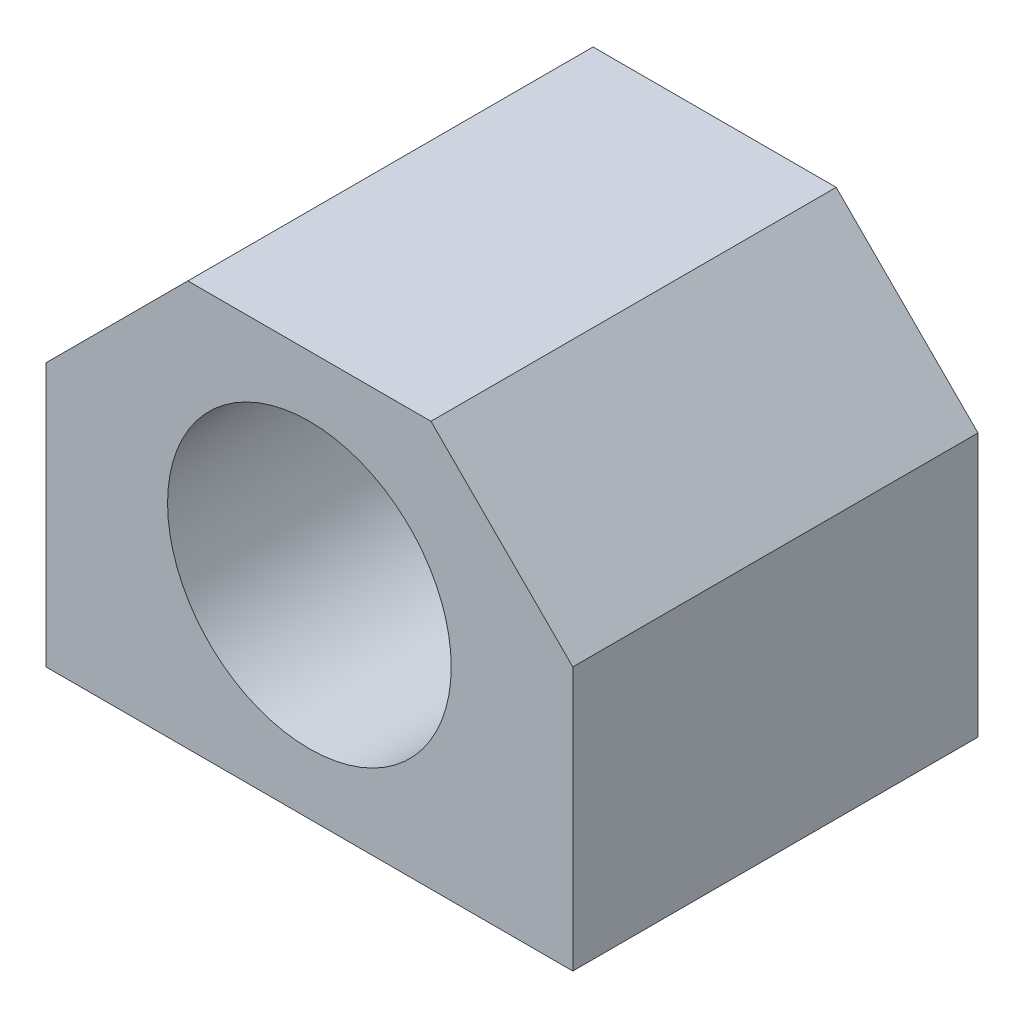
ISO-10303-21;
HEADER;
FILE_DESCRIPTION(('STEP AP214'),'2;1');
FILE_NAME('part.step','',(''),(''),'','','');
FILE_SCHEMA(('AUTOMOTIVE_DESIGN { 1 0 10303 214 1 1 1 1 }'));
ENDSEC;
DATA;
#1=APPLICATION_CONTEXT('core data for automotive mechanical design processes');
#2=APPLICATION_PROTOCOL_DEFINITION('international standard','automotive_design',2000,#1);
#3=PRODUCT_CONTEXT('',#1,'mechanical');
#4=PRODUCT('Part','Part','',(#3));
#5=PRODUCT_RELATED_PRODUCT_CATEGORY('part','',(#4));
#6=PRODUCT_DEFINITION_FORMATION('','',#4);
#7=PRODUCT_DEFINITION_CONTEXT('part definition',#1,'design');
#8=PRODUCT_DEFINITION('design','',#6,#7);
#9=PRODUCT_DEFINITION_SHAPE('','',#8);
#10=(LENGTH_UNIT() NAMED_UNIT(*) SI_UNIT(.MILLI.,.METRE.));
#11=(NAMED_UNIT(*) PLANE_ANGLE_UNIT() SI_UNIT($,.RADIAN.));
#12=(NAMED_UNIT(*) SI_UNIT($,.STERADIAN.) SOLID_ANGLE_UNIT());
#13=UNCERTAINTY_MEASURE_WITH_UNIT(LENGTH_MEASURE(1.E-05),#10,'distance_accuracy_value','');
#14=(GEOMETRIC_REPRESENTATION_CONTEXT(3) GLOBAL_UNCERTAINTY_ASSIGNED_CONTEXT((#13)) GLOBAL_UNIT_ASSIGNED_CONTEXT((#10,
#11,#12)) REPRESENTATION_CONTEXT('',''));
#15=CARTESIAN_POINT('',(0.,0.,0.));
#16=DIRECTION('',(0.,0.,1.));
#17=DIRECTION('',(1.,0.,0.));
#18=AXIS2_PLACEMENT_3D('',#15,#16,#17);
#19=CARTESIAN_POINT('',(-26.,26.,40.));
#20=DIRECTION('',(1.,0.,0.));
#21=DIRECTION('',(0.,1.,0.));
#22=AXIS2_PLACEMENT_3D('',#19,#20,#21);
#23=PLANE('',#22);
#24=DIRECTION('',(0.,-1.,0.));
#25=VECTOR('',#24,1.);
#26=CARTESIAN_POINT('',(-26.,26.,0.));
#27=LINE('',#26,#25);
#28=CARTESIAN_POINT('',(-26.,26.,0.));
#29=VERTEX_POINT('',#28);
#30=CARTESIAN_POINT('',(-26.,0.,0.));
#31=VERTEX_POINT('',#30);
#32=EDGE_CURVE('E117',#29,#31,#27,.T.);
#33=ORIENTED_EDGE('',*,*,#32,.T.);
#34=DIRECTION('',(0.,0.,-1.));
#35=VECTOR('',#34,1.);
#36=CARTESIAN_POINT('',(-26.,0.,40.));
#37=LINE('',#36,#35);
#38=CARTESIAN_POINT('',(-26.,0.,40.));
#39=VERTEX_POINT('',#38);
#40=EDGE_CURVE('E11',#39,#31,#37,.T.);
#41=ORIENTED_EDGE('',*,*,#40,.F.);
#42=DIRECTION('',(0.,-1.,0.));
#43=VECTOR('',#42,1.);
#44=CARTESIAN_POINT('',(-26.,26.,40.));
#45=LINE('',#44,#43);
#46=CARTESIAN_POINT('',(-26.,26.,40.));
#47=VERTEX_POINT('',#46);
#48=EDGE_CURVE('E128',#47,#39,#45,.T.);
#49=ORIENTED_EDGE('',*,*,#48,.F.);
#50=DIRECTION('',(0.,0.,-1.));
#51=VECTOR('',#50,1.);
#52=CARTESIAN_POINT('',(-26.,26.,40.));
#53=LINE('',#52,#51);
#54=EDGE_CURVE('E113',#47,#29,#53,.T.);
#55=ORIENTED_EDGE('',*,*,#54,.T.);
#56=EDGE_LOOP('',(#33,#41,#49,#55));
#57=FACE_BOUND('',#56,.T.);
#58=ADVANCED_FACE('F33',(#57),#23,.F.);
#59=CARTESIAN_POINT('',(-26.,0.,40.));
#60=DIRECTION('',(0.,1.,0.));
#61=DIRECTION('',(-1.,0.,0.));
#62=AXIS2_PLACEMENT_3D('',#59,#60,#61);
#63=PLANE('',#62);
#64=CARTESIAN_POINT('',(20.,0.,32.));
#65=DIRECTION('',(0.,-1.,0.));
#66=DIRECTION('',(1.,0.,0.));
#67=AXIS2_PLACEMENT_3D('',#64,#65,#66);
#68=CIRCLE('',#67,2.1);
#69=CARTESIAN_POINT('',(22.1,0.,32.));
#70=VERTEX_POINT('',#69);
#71=EDGE_CURVE('E296',#70,#70,#68,.T.);
#72=ORIENTED_EDGE('',*,*,#71,.F.);
#73=EDGE_LOOP('',(#72));
#74=FACE_BOUND('',#73,.T.);
#75=CARTESIAN_POINT('',(-20.,0.,8.));
#76=DIRECTION('',(0.,-1.,0.));
#77=DIRECTION('',(1.,0.,0.));
#78=AXIS2_PLACEMENT_3D('',#75,#76,#77);
#79=CIRCLE('',#78,2.1);
#80=CARTESIAN_POINT('',(-17.9,0.,8.));
#81=VERTEX_POINT('',#80);
#82=EDGE_CURVE('E307',#81,#81,#79,.T.);
#83=ORIENTED_EDGE('',*,*,#82,.F.);
#84=EDGE_LOOP('',(#83));
#85=FACE_BOUND('',#84,.T.);
#86=CARTESIAN_POINT('',(20.,0.,8.));
#87=DIRECTION('',(0.,-1.,0.));
#88=DIRECTION('',(1.,0.,0.));
#89=AXIS2_PLACEMENT_3D('',#86,#87,#88);
#90=CIRCLE('',#89,2.1);
#91=CARTESIAN_POINT('',(22.1,0.,8.));
#92=VERTEX_POINT('',#91);
#93=EDGE_CURVE('E313',#92,#92,#90,.T.);
#94=ORIENTED_EDGE('',*,*,#93,.F.);
#95=EDGE_LOOP('',(#94));
#96=FACE_BOUND('',#95,.T.);
#97=CARTESIAN_POINT('',(-20.,0.,32.));
#98=DIRECTION('',(0.,-1.,0.));
#99=DIRECTION('',(1.,0.,0.));
#100=AXIS2_PLACEMENT_3D('',#97,#98,#99);
#101=CIRCLE('',#100,2.1);
#102=CARTESIAN_POINT('',(-17.9,0.,32.));
#103=VERTEX_POINT('',#102);
#104=EDGE_CURVE('E295',#103,#103,#101,.T.);
#105=ORIENTED_EDGE('',*,*,#104,.F.);
#106=EDGE_LOOP('',(#105));
#107=FACE_BOUND('',#106,.T.);
#108=DIRECTION('',(1.,0.,0.));
#109=VECTOR('',#108,1.);
#110=CARTESIAN_POINT('',(-26.,0.,0.));
#111=LINE('',#110,#109);
#112=CARTESIAN_POINT('',(26.,0.,0.));
#113=VERTEX_POINT('',#112);
#114=EDGE_CURVE('E120',#31,#113,#111,.T.);
#115=ORIENTED_EDGE('',*,*,#114,.T.);
#116=DIRECTION('',(0.,0.,-1.));
#117=VECTOR('',#116,1.);
#118=CARTESIAN_POINT('',(26.,0.,40.));
#119=LINE('',#118,#117);
#120=CARTESIAN_POINT('',(26.,0.,40.));
#121=VERTEX_POINT('',#120);
#122=EDGE_CURVE('E41',#121,#113,#119,.T.);
#123=ORIENTED_EDGE('',*,*,#122,.F.);
#124=DIRECTION('',(1.,0.,0.));
#125=VECTOR('',#124,1.);
#126=CARTESIAN_POINT('',(-26.,0.,40.));
#127=LINE('',#126,#125);
#128=EDGE_CURVE('E86',#39,#121,#127,.T.);
#129=ORIENTED_EDGE('',*,*,#128,.F.);
#130=ORIENTED_EDGE('',*,*,#40,.T.);
#131=EDGE_LOOP('',(#115,#123,#129,#130));
#132=FACE_BOUND('',#131,.T.);
#133=ADVANCED_FACE('F153',(#74,#85,#96,#107,#132),#63,.F.);
#134=CARTESIAN_POINT('',(26.,0.,40.));
#135=DIRECTION('',(-1.,0.,0.));
#136=DIRECTION('',(0.,-1.,0.));
#137=AXIS2_PLACEMENT_3D('',#134,#135,#136);
#138=PLANE('',#137);
#139=DIRECTION('',(0.,1.,0.));
#140=VECTOR('',#139,1.);
#141=CARTESIAN_POINT('',(26.,0.,0.));
#142=LINE('',#141,#140);
#143=CARTESIAN_POINT('',(26.,26.0000000000001,0.));
#144=VERTEX_POINT('',#143);
#145=EDGE_CURVE('E123',#113,#144,#142,.T.);
#146=ORIENTED_EDGE('',*,*,#145,.T.);
#147=DIRECTION('',(0.,0.,-1.));
#148=VECTOR('',#147,1.);
#149=CARTESIAN_POINT('',(26.,26.0000000000001,40.));
#150=LINE('',#149,#148);
#151=CARTESIAN_POINT('',(26.,26.0000000000001,40.));
#152=VERTEX_POINT('',#151);
#153=EDGE_CURVE('E108',#152,#144,#150,.T.);
#154=ORIENTED_EDGE('',*,*,#153,.F.);
#155=DIRECTION('',(0.,1.,0.));
#156=VECTOR('',#155,1.);
#157=CARTESIAN_POINT('',(26.,0.,40.));
#158=LINE('',#157,#156);
#159=EDGE_CURVE('E99',#121,#152,#158,.T.);
#160=ORIENTED_EDGE('',*,*,#159,.F.);
#161=ORIENTED_EDGE('',*,*,#122,.T.);
#162=EDGE_LOOP('',(#146,#154,#160,#161));
#163=FACE_BOUND('',#162,.T.);
#164=ADVANCED_FACE('F134',(#163),#138,.F.);
#165=CARTESIAN_POINT('',(26.,26.0000000000001,40.));
#166=DIRECTION('',(-0.707106781186546,-0.707106781186549,0.));
#167=DIRECTION('',(0.707106781186549,-0.707106781186546,0.));
#168=AXIS2_PLACEMENT_3D('',#165,#166,#167);
#169=PLANE('',#168);
#170=DIRECTION('',(-0.707106781186549,0.707106781186546,0.));
#171=VECTOR('',#170,1.);
#172=CARTESIAN_POINT('',(26.,26.0000000000001,0.));
#173=LINE('',#172,#171);
#174=CARTESIAN_POINT('',(12.,40.,0.));
#175=VERTEX_POINT('',#174);
#176=EDGE_CURVE('E107',#144,#175,#173,.T.);
#177=ORIENTED_EDGE('',*,*,#176,.T.);
#178=DIRECTION('',(0.,0.,-1.));
#179=VECTOR('',#178,1.);
#180=CARTESIAN_POINT('',(12.,40.,40.));
#181=LINE('',#180,#179);
#182=CARTESIAN_POINT('',(12.,40.,40.));
#183=VERTEX_POINT('',#182);
#184=EDGE_CURVE('E104',#183,#175,#181,.T.);
#185=ORIENTED_EDGE('',*,*,#184,.F.);
#186=DIRECTION('',(-0.707106781186549,0.707106781186546,0.));
#187=VECTOR('',#186,1.);
#188=CARTESIAN_POINT('',(26.,26.0000000000001,40.));
#189=LINE('',#188,#187);
#190=EDGE_CURVE('E93',#152,#183,#189,.T.);
#191=ORIENTED_EDGE('',*,*,#190,.F.);
#192=ORIENTED_EDGE('',*,*,#153,.T.);
#193=EDGE_LOOP('',(#177,#185,#191,#192));
#194=FACE_BOUND('',#193,.T.);
#195=ADVANCED_FACE('F105',(#194),#169,.F.);
#196=CARTESIAN_POINT('',(12.,40.,40.));
#197=DIRECTION('',(0.,-1.,0.));
#198=DIRECTION('',(0.,0.,-1.));
#199=AXIS2_PLACEMENT_3D('',#196,#197,#198);
#200=PLANE('',#199);
#201=DIRECTION('',(-1.,0.,0.));
#202=VECTOR('',#201,1.);
#203=CARTESIAN_POINT('',(12.,40.,0.));
#204=LINE('',#203,#202);
#205=CARTESIAN_POINT('',(-12.,40.,0.));
#206=VERTEX_POINT('',#205);
#207=EDGE_CURVE('E72',#175,#206,#204,.T.);
#208=ORIENTED_EDGE('',*,*,#207,.T.);
#209=DIRECTION('',(0.,0.,-1.));
#210=VECTOR('',#209,1.);
#211=CARTESIAN_POINT('',(-12.,40.,40.));
#212=LINE('',#211,#210);
#213=CARTESIAN_POINT('',(-12.,40.,40.));
#214=VERTEX_POINT('',#213);
#215=EDGE_CURVE('E109',#214,#206,#212,.T.);
#216=ORIENTED_EDGE('',*,*,#215,.F.);
#217=DIRECTION('',(-1.,0.,0.));
#218=VECTOR('',#217,1.);
#219=CARTESIAN_POINT('',(12.,40.,40.));
#220=LINE('',#219,#218);
#221=EDGE_CURVE('E97',#183,#214,#220,.T.);
#222=ORIENTED_EDGE('',*,*,#221,.F.);
#223=ORIENTED_EDGE('',*,*,#184,.T.);
#224=EDGE_LOOP('',(#208,#216,#222,#223));
#225=FACE_BOUND('',#224,.T.);
#226=ADVANCED_FACE('F111',(#225),#200,.F.);
#227=CARTESIAN_POINT('',(-12.,40.,40.));
#228=DIRECTION('',(0.707106781186547,-0.707106781186548,0.));
#229=DIRECTION('',(0.707106781186548,0.707106781186547,0.));
#230=AXIS2_PLACEMENT_3D('',#227,#228,#229);
#231=PLANE('',#230);
#232=DIRECTION('',(-0.707106781186548,-0.707106781186547,0.));
#233=VECTOR('',#232,1.);
#234=CARTESIAN_POINT('',(-12.,40.,0.));
#235=LINE('',#234,#233);
#236=EDGE_CURVE('E78',#206,#29,#235,.T.);
#237=ORIENTED_EDGE('',*,*,#236,.T.);
#238=ORIENTED_EDGE('',*,*,#54,.F.);
#239=DIRECTION('',(-0.707106781186548,-0.707106781186547,0.));
#240=VECTOR('',#239,1.);
#241=CARTESIAN_POINT('',(-12.,40.,40.));
#242=LINE('',#241,#240);
#243=EDGE_CURVE('E49',#214,#47,#242,.T.);
#244=ORIENTED_EDGE('',*,*,#243,.F.);
#245=ORIENTED_EDGE('',*,*,#215,.T.);
#246=EDGE_LOOP('',(#237,#238,#244,#245));
#247=FACE_BOUND('',#246,.T.);
#248=ADVANCED_FACE('F141',(#247),#231,.F.);
#249=CARTESIAN_POINT('',(0.,0.,40.));
#250=DIRECTION('',(0.,0.,1.));
#251=DIRECTION('',(1.,0.,0.));
#252=AXIS2_PLACEMENT_3D('',#249,#250,#251);
#253=PLANE('',#252);
#254=CARTESIAN_POINT('',(0.,20.,40.));
#255=DIRECTION('',(0.,0.,1.));
#256=DIRECTION('',(1.,0.,0.));
#257=AXIS2_PLACEMENT_3D('',#254,#255,#256);
#258=CIRCLE('',#257,14.);
#259=CARTESIAN_POINT('',(14.,20.,40.));
#260=VERTEX_POINT('',#259);
#261=EDGE_CURVE('E317',#260,#260,#258,.T.);
#262=ORIENTED_EDGE('',*,*,#261,.F.);
#263=EDGE_LOOP('',(#262));
#264=FACE_BOUND('',#263,.T.);
#265=ORIENTED_EDGE('',*,*,#48,.T.);
#266=ORIENTED_EDGE('',*,*,#128,.T.);
#267=ORIENTED_EDGE('',*,*,#159,.T.);
#268=ORIENTED_EDGE('',*,*,#190,.T.);
#269=ORIENTED_EDGE('',*,*,#221,.T.);
#270=ORIENTED_EDGE('',*,*,#243,.T.);
#271=EDGE_LOOP('',(#265,#266,#267,#268,#269,#270));
#272=FACE_BOUND('',#271,.T.);
#273=ADVANCED_FACE('F95',(#264,#272),#253,.T.);
#274=CARTESIAN_POINT('',(0.,0.,0.));
#275=DIRECTION('',(0.,0.,1.));
#276=DIRECTION('',(1.,0.,0.));
#277=AXIS2_PLACEMENT_3D('',#274,#275,#276);
#278=PLANE('',#277);
#279=CARTESIAN_POINT('',(0.,20.,0.));
#280=DIRECTION('',(0.,0.,1.));
#281=DIRECTION('',(1.,0.,0.));
#282=AXIS2_PLACEMENT_3D('',#279,#280,#281);
#283=CIRCLE('',#282,14.);
#284=CARTESIAN_POINT('',(14.,20.,0.));
#285=VERTEX_POINT('',#284);
#286=EDGE_CURVE('E121',#285,#285,#283,.T.);
#287=ORIENTED_EDGE('',*,*,#286,.T.);
#288=EDGE_LOOP('',(#287));
#289=FACE_BOUND('',#288,.T.);
#290=ORIENTED_EDGE('',*,*,#32,.F.);
#291=ORIENTED_EDGE('',*,*,#236,.F.);
#292=ORIENTED_EDGE('',*,*,#207,.F.);
#293=ORIENTED_EDGE('',*,*,#176,.F.);
#294=ORIENTED_EDGE('',*,*,#145,.F.);
#295=ORIENTED_EDGE('',*,*,#114,.F.);
#296=EDGE_LOOP('',(#290,#291,#292,#293,#294,#295));
#297=FACE_BOUND('',#296,.T.);
#298=ADVANCED_FACE('F137',(#289,#297),#278,.F.);
#299=CARTESIAN_POINT('',(0.,20.,0.));
#300=DIRECTION('',(0.,0.,1.));
#301=DIRECTION('',(1.,0.,0.));
#302=AXIS2_PLACEMENT_3D('',#299,#300,#301);
#303=CYLINDRICAL_SURFACE('',#302,14.);
#304=ORIENTED_EDGE('',*,*,#286,.F.);
#305=EDGE_LOOP('',(#304));
#306=FACE_BOUND('',#305,.T.);
#307=ORIENTED_EDGE('',*,*,#261,.T.);
#308=EDGE_LOOP('',(#307));
#309=FACE_BOUND('',#308,.T.);
#310=ADVANCED_FACE('F193',(#306,#309),#303,.F.);
#311=CARTESIAN_POINT('',(-20.,15.,32.));
#312=DIRECTION('',(0.,-1.,0.));
#313=DIRECTION('',(1.,0.,0.));
#314=AXIS2_PLACEMENT_3D('',#311,#312,#313);
#315=CYLINDRICAL_SURFACE('',#314,2.1);
#316=CARTESIAN_POINT('',(-20.,15.,32.));
#317=DIRECTION('',(0.,-1.,0.));
#318=DIRECTION('',(1.,0.,0.));
#319=AXIS2_PLACEMENT_3D('',#316,#317,#318);
#320=CIRCLE('',#319,2.1);
#321=CARTESIAN_POINT('',(-17.9,15.,32.));
#322=VERTEX_POINT('',#321);
#323=EDGE_CURVE('E299',#322,#322,#320,.T.);
#324=ORIENTED_EDGE('',*,*,#323,.F.);
#325=EDGE_LOOP('',(#324));
#326=FACE_BOUND('',#325,.T.);
#327=ORIENTED_EDGE('',*,*,#104,.T.);
#328=EDGE_LOOP('',(#327));
#329=FACE_BOUND('',#328,.T.);
#330=ADVANCED_FACE('F201',(#326,#329),#315,.F.);
#331=CARTESIAN_POINT('',(-20.,15.,32.));
#332=DIRECTION('',(0.,-1.,0.));
#333=DIRECTION('',(1.,0.,0.));
#334=AXIS2_PLACEMENT_3D('',#331,#332,#333);
#335=PLANE('',#334);
#336=ORIENTED_EDGE('',*,*,#323,.T.);
#337=EDGE_LOOP('',(#336));
#338=FACE_BOUND('',#337,.T.);
#339=ADVANCED_FACE('F218',(#338),#335,.T.);
#340=CARTESIAN_POINT('',(20.,15.,8.));
#341=DIRECTION('',(0.,-1.,0.));
#342=DIRECTION('',(1.,0.,0.));
#343=AXIS2_PLACEMENT_3D('',#340,#341,#342);
#344=CYLINDRICAL_SURFACE('',#343,2.1);
#345=CARTESIAN_POINT('',(20.,15.,8.));
#346=DIRECTION('',(0.,-1.,0.));
#347=DIRECTION('',(1.,0.,0.));
#348=AXIS2_PLACEMENT_3D('',#345,#346,#347);
#349=CIRCLE('',#348,2.1);
#350=CARTESIAN_POINT('',(22.1,15.,8.));
#351=VERTEX_POINT('',#350);
#352=EDGE_CURVE('E310',#351,#351,#349,.T.);
#353=ORIENTED_EDGE('',*,*,#352,.F.);
#354=EDGE_LOOP('',(#353));
#355=FACE_BOUND('',#354,.T.);
#356=ORIENTED_EDGE('',*,*,#93,.T.);
#357=EDGE_LOOP('',(#356));
#358=FACE_BOUND('',#357,.T.);
#359=ADVANCED_FACE('F228',(#355,#358),#344,.F.);
#360=CARTESIAN_POINT('',(20.,15.,8.));
#361=DIRECTION('',(0.,-1.,0.));
#362=DIRECTION('',(1.,0.,0.));
#363=AXIS2_PLACEMENT_3D('',#360,#361,#362);
#364=PLANE('',#363);
#365=ORIENTED_EDGE('',*,*,#352,.T.);
#366=EDGE_LOOP('',(#365));
#367=FACE_BOUND('',#366,.T.);
#368=ADVANCED_FACE('F238',(#367),#364,.T.);
#369=CARTESIAN_POINT('',(-20.,15.,8.));
#370=DIRECTION('',(0.,-1.,0.));
#371=DIRECTION('',(1.,0.,0.));
#372=AXIS2_PLACEMENT_3D('',#369,#370,#371);
#373=CYLINDRICAL_SURFACE('',#372,2.1);
#374=CARTESIAN_POINT('',(-20.,15.,8.));
#375=DIRECTION('',(0.,-1.,0.));
#376=DIRECTION('',(1.,0.,0.));
#377=AXIS2_PLACEMENT_3D('',#374,#375,#376);
#378=CIRCLE('',#377,2.1);
#379=CARTESIAN_POINT('',(-17.9,15.,8.));
#380=VERTEX_POINT('',#379);
#381=EDGE_CURVE('E302',#380,#380,#378,.T.);
#382=ORIENTED_EDGE('',*,*,#381,.F.);
#383=EDGE_LOOP('',(#382));
#384=FACE_BOUND('',#383,.T.);
#385=ORIENTED_EDGE('',*,*,#82,.T.);
#386=EDGE_LOOP('',(#385));
#387=FACE_BOUND('',#386,.T.);
#388=ADVANCED_FACE('F248',(#384,#387),#373,.F.);
#389=CARTESIAN_POINT('',(-20.,15.,8.));
#390=DIRECTION('',(0.,-1.,0.));
#391=DIRECTION('',(1.,0.,0.));
#392=AXIS2_PLACEMENT_3D('',#389,#390,#391);
#393=PLANE('',#392);
#394=ORIENTED_EDGE('',*,*,#381,.T.);
#395=EDGE_LOOP('',(#394));
#396=FACE_BOUND('',#395,.T.);
#397=ADVANCED_FACE('F258',(#396),#393,.T.);
#398=CARTESIAN_POINT('',(20.,15.,32.));
#399=DIRECTION('',(0.,-1.,0.));
#400=DIRECTION('',(1.,0.,0.));
#401=AXIS2_PLACEMENT_3D('',#398,#399,#400);
#402=CYLINDRICAL_SURFACE('',#401,2.1);
#403=CARTESIAN_POINT('',(20.,15.,32.));
#404=DIRECTION('',(0.,-1.,0.));
#405=DIRECTION('',(1.,0.,0.));
#406=AXIS2_PLACEMENT_3D('',#403,#404,#405);
#407=CIRCLE('',#406,2.1);
#408=CARTESIAN_POINT('',(22.1,15.,32.));
#409=VERTEX_POINT('',#408);
#410=EDGE_CURVE('E294',#409,#409,#407,.T.);
#411=ORIENTED_EDGE('',*,*,#410,.F.);
#412=EDGE_LOOP('',(#411));
#413=FACE_BOUND('',#412,.T.);
#414=ORIENTED_EDGE('',*,*,#71,.T.);
#415=EDGE_LOOP('',(#414));
#416=FACE_BOUND('',#415,.T.);
#417=ADVANCED_FACE('F268',(#413,#416),#402,.F.);
#418=CARTESIAN_POINT('',(20.,15.,32.));
#419=DIRECTION('',(0.,-1.,0.));
#420=DIRECTION('',(1.,0.,0.));
#421=AXIS2_PLACEMENT_3D('',#418,#419,#420);
#422=PLANE('',#421);
#423=ORIENTED_EDGE('',*,*,#410,.T.);
#424=EDGE_LOOP('',(#423));
#425=FACE_BOUND('',#424,.T.);
#426=ADVANCED_FACE('F278',(#425),#422,.T.);
#427=CLOSED_SHELL('',(#58,#133,#164,#195,#226,#248,#273,#298,#310,#330,#339,#359,#368,#388,#397,
#417,#426));
#428=MANIFOLD_SOLID_BREP('B2',#427);
#429=ADVANCED_BREP_SHAPE_REPRESENTATION('',(#18,#428),#14);
#430=SHAPE_DEFINITION_REPRESENTATION(#9,#429);
ENDSEC;
END-ISO-10303-21;
